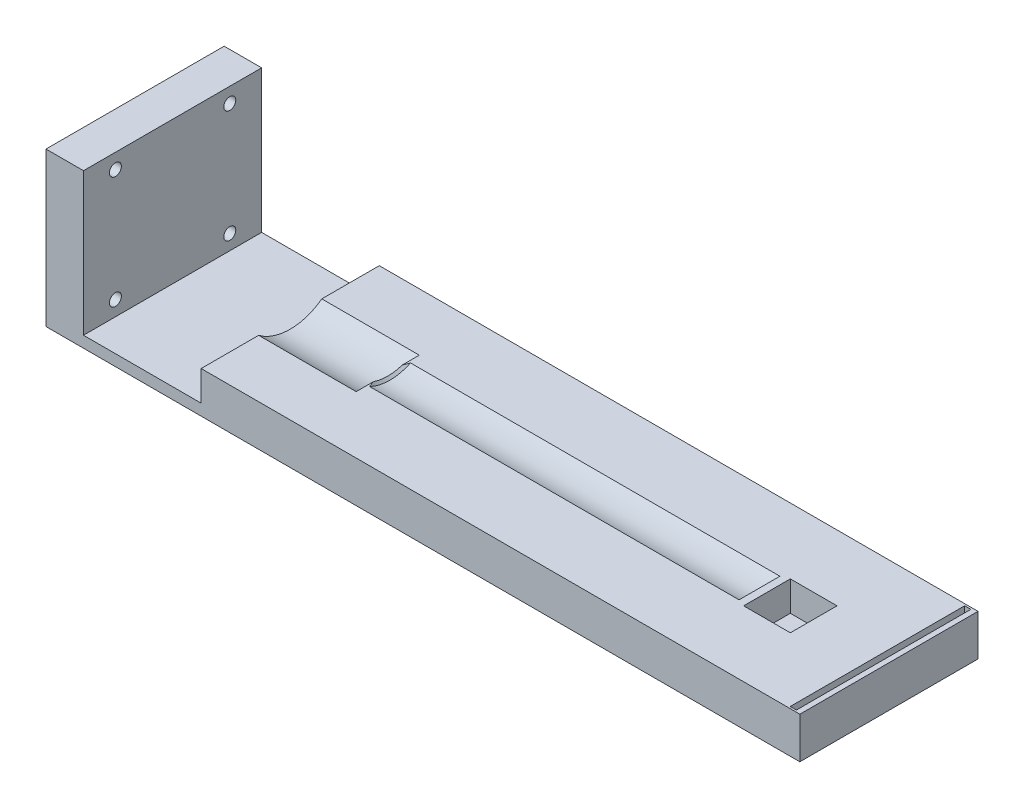
ISO-10303-21;
HEADER;
FILE_DESCRIPTION(('STEP AP214'),'2;1');
FILE_NAME('part.step','',(''),(''),'','','');
FILE_SCHEMA(('AUTOMOTIVE_DESIGN { 1 0 10303 214 1 1 1 1 }'));
ENDSEC;
DATA;
#1=APPLICATION_CONTEXT('core data for automotive mechanical design processes');
#2=APPLICATION_PROTOCOL_DEFINITION('international standard','automotive_design',2000,#1);
#3=PRODUCT_CONTEXT('',#1,'mechanical');
#4=PRODUCT('Part','Part','',(#3));
#5=PRODUCT_RELATED_PRODUCT_CATEGORY('part','',(#4));
#6=PRODUCT_DEFINITION_FORMATION('','',#4);
#7=PRODUCT_DEFINITION_CONTEXT('part definition',#1,'design');
#8=PRODUCT_DEFINITION('design','',#6,#7);
#9=PRODUCT_DEFINITION_SHAPE('','',#8);
#10=(LENGTH_UNIT() NAMED_UNIT(*) SI_UNIT(.MILLI.,.METRE.));
#11=(NAMED_UNIT(*) PLANE_ANGLE_UNIT() SI_UNIT($,.RADIAN.));
#12=(NAMED_UNIT(*) SI_UNIT($,.STERADIAN.) SOLID_ANGLE_UNIT());
#13=UNCERTAINTY_MEASURE_WITH_UNIT(LENGTH_MEASURE(1.E-05),#10,'distance_accuracy_value','');
#14=(GEOMETRIC_REPRESENTATION_CONTEXT(3) GLOBAL_UNCERTAINTY_ASSIGNED_CONTEXT((#13)) GLOBAL_UNIT_ASSIGNED_CONTEXT((#10,
#11,#12)) REPRESENTATION_CONTEXT('',''));
#15=CARTESIAN_POINT('',(0.,0.,0.));
#16=DIRECTION('',(0.,0.,1.));
#17=DIRECTION('',(1.,0.,0.));
#18=AXIS2_PLACEMENT_3D('',#15,#16,#17);
#19=CARTESIAN_POINT('',(0.,38.,0.));
#20=DIRECTION('',(0.,1.,0.));
#21=DIRECTION('',(0.,0.,1.));
#22=AXIS2_PLACEMENT_3D('',#19,#20,#21);
#23=PLANE('',#22);
#24=DIRECTION('',(1.,0.,0.));
#25=VECTOR('',#24,1.);
#26=CARTESIAN_POINT('',(586.457736953419,38.,1398.46078665923));
#27=LINE('',#26,#25);
#28=CARTESIAN_POINT('',(584.80773695342,38.,1398.46078665923));
#29=VERTEX_POINT('',#28);
#30=CARTESIAN_POINT('',(586.457736953419,38.,1398.46078665923));
#31=VERTEX_POINT('',#30);
#32=EDGE_CURVE('E159',#29,#31,#27,.T.);
#33=ORIENTED_EDGE('',*,*,#32,.F.);
#34=DIRECTION('',(0.,0.,1.));
#35=VECTOR('',#34,1.);
#36=CARTESIAN_POINT('',(584.80773695342,38.,1398.46078665923));
#37=LINE('',#36,#35);
#38=CARTESIAN_POINT('',(584.80773695342,38.,1351.96078665923));
#39=VERTEX_POINT('',#38);
#40=EDGE_CURVE('E308',#39,#29,#37,.T.);
#41=ORIENTED_EDGE('',*,*,#40,.F.);
#42=DIRECTION('',(-1.,0.,0.));
#43=VECTOR('',#42,1.);
#44=CARTESIAN_POINT('',(584.80773695342,38.,1351.96078665923));
#45=LINE('',#44,#43);
#46=CARTESIAN_POINT('',(586.457736953419,38.,1351.96078665923));
#47=VERTEX_POINT('',#46);
#48=EDGE_CURVE('E311',#47,#39,#45,.T.);
#49=ORIENTED_EDGE('',*,*,#48,.F.);
#50=DIRECTION('',(0.,0.,-1.));
#51=VECTOR('',#50,1.);
#52=CARTESIAN_POINT('',(586.457736953419,38.,1351.96078665923));
#53=LINE('',#52,#51);
#54=EDGE_CURVE('E317',#31,#47,#53,.T.);
#55=ORIENTED_EDGE('',*,*,#54,.F.);
#56=EDGE_LOOP('',(#33,#41,#49,#55));
#57=FACE_BOUND('',#56,.T.);
#58=DIRECTION('',(0.,0.,1.));
#59=VECTOR('',#58,1.);
#60=CARTESIAN_POINT('',(428.238471137286,38.,1355.96078649868));
#61=LINE('',#60,#59);
#62=CARTESIAN_POINT('',(428.238471137286,38.,1351.46078649868));
#63=VERTEX_POINT('',#62);
#64=CARTESIAN_POINT('',(428.238471137286,38.,1366.79413649423));
#65=VERTEX_POINT('',#64);
#66=EDGE_CURVE('E336',#63,#65,#61,.T.);
#67=ORIENTED_EDGE('',*,*,#66,.T.);
#68=DIRECTION('',(-1.,0.,0.));
#69=VECTOR('',#68,1.);
#70=CARTESIAN_POINT('',(454.238471137286,38.,1366.79413649423));
#71=LINE('',#70,#69);
#72=CARTESIAN_POINT('',(454.238471137286,38.,1366.79413649423));
#73=VERTEX_POINT('',#72);
#74=EDGE_CURVE('E355',#65,#73,#71,.F.);
#75=ORIENTED_EDGE('',*,*,#74,.T.);
#76=DIRECTION('',(0.,0.,-1.));
#77=VECTOR('',#76,1.);
#78=CARTESIAN_POINT('',(454.238471137286,38.,0.));
#79=LINE('',#78,#77);
#80=CARTESIAN_POINT('',(454.238471137286,38.,1371.35244531893));
#81=VERTEX_POINT('',#80);
#82=EDGE_CURVE('E364',#81,#73,#79,.T.);
#83=ORIENTED_EDGE('',*,*,#82,.F.);
#84=CARTESIAN_POINT('',(454.85843695342,38.,1369.76058969961));
#85=CARTESIAN_POINT('',(454.687245121652,38.,1370.14528895966));
#86=CARTESIAN_POINT('',(454.528040637761,38.,1370.53602997257));
#87=CARTESIAN_POINT('',(454.23998352128,38.,1371.33005467567));
#88=CARTESIAN_POINT('',(454.111242272088,38.,1371.733378472));
#89=CARTESIAN_POINT('',(453.947262232903,38.,1372.34384819718));
#90=CARTESIAN_POINT('',(453.897649155964,38.,1372.5471356974));
#91=CARTESIAN_POINT('',(453.808555258525,38.,1372.955903581));
#92=CARTESIAN_POINT('',(453.769072974235,38.,1373.16138364311));
#93=CARTESIAN_POINT('',(453.701011658274,38.,1373.57387141667));
#94=CARTESIAN_POINT('',(453.672418280449,38.,1373.78087674924));
#95=CARTESIAN_POINT('',(453.62664030239,38.,1374.19614968094));
#96=CARTESIAN_POINT('',(453.609455441376,38.,1374.4044172511));
#97=CARTESIAN_POINT('',(453.587528775331,38.,1374.80929197523));
#98=CARTESIAN_POINT('',(453.582113145668,38.,1375.00586272785));
#99=CARTESIAN_POINT('',(453.581815278053,38.,1375.39900144742));
#100=CARTESIAN_POINT('',(453.586932439691,38.,1375.5955694139));
#101=CARTESIAN_POINT('',(453.607605760803,38.,1375.98823841877));
#102=CARTESIAN_POINT('',(453.623166307173,38.,1376.18433922617));
#103=CARTESIAN_POINT('',(453.664425939787,38.,1376.57548141519));
#104=CARTESIAN_POINT('',(453.690126487847,38.,1376.77052263995));
#105=CARTESIAN_POINT('',(453.781753309234,38.,1377.35316285786));
#106=CARTESIAN_POINT('',(453.862219370598,38.,1377.73853708681));
#107=CARTESIAN_POINT('',(454.056890061808,38.,1378.50062348835));
#108=CARTESIAN_POINT('',(454.171106309887,38.,1378.87733262985));
#109=CARTESIAN_POINT('',(454.340634871859,38.,1379.36898068917));
#110=CARTESIAN_POINT('',(454.38343477763,38.,1379.48837303201));
#111=CARTESIAN_POINT('',(454.471749895319,38.,1379.72610086492));
#112=CARTESIAN_POINT('',(454.517263993479,38.,1379.8444367659));
#113=CARTESIAN_POINT('',(454.61068591144,38.,1380.07969919944));
#114=CARTESIAN_POINT('',(454.658585240472,38.,1380.19662911642));
#115=CARTESIAN_POINT('',(454.756767725996,38.,1380.42953171805));
#116=CARTESIAN_POINT('',(454.807051695879,38.,1380.54550406));
#117=CARTESIAN_POINT('',(454.85843695342,38.,1380.66098361884));
#118=B_SPLINE_CURVE_WITH_KNOTS('',3,(#84,#85,#86,#87,#88,#89,#90,#91,#92,#93,#94,#95,#96,#97,
#98,#99,#100,#101,#102,#103,#104,#105,#106,#107,#108,#109,#110,#111,#112,#113,#114,#115,#116,
#117),.UNSPECIFIED.,.F.,.F.,(4,2,2,2,2,2,2,2,2,2,2,2,2,2,2,2,4),(0.,1.26404332694489,
2.53263935458804,3.16017054690521,3.78761101652659,4.41422194846123,5.04081855667202,
5.63047575284557,6.22009933725068,6.80997075679138,7.39992724520645,8.57906657195127,
9.75861228181269,10.1390914324494,10.5194155153526,10.8984710074119,11.2776567369307),.UNSPECIFIED.);
#119=CARTESIAN_POINT('',(454.85773695342,38.,1369.7621629798));
#120=VERTEX_POINT('',#119);
#121=EDGE_CURVE('E376',#120,#81,#118,.T.);
#122=ORIENTED_EDGE('',*,*,#121,.F.);
#123=DIRECTION('',(1.,0.,0.));
#124=VECTOR('',#123,1.);
#125=CARTESIAN_POINT('',(449.85773695342,38.,1369.7621629798));
#126=LINE('',#125,#124);
#127=CARTESIAN_POINT('',(553.357736953419,38.,1369.7621629798));
#128=VERTEX_POINT('',#127);
#129=EDGE_CURVE('E351',#120,#128,#126,.T.);
#130=ORIENTED_EDGE('',*,*,#129,.T.);
#131=DIRECTION('',(0.,0.,1.));
#132=VECTOR('',#131,1.);
#133=CARTESIAN_POINT('',(553.357736953419,38.,0.));
#134=LINE('',#133,#132);
#135=CARTESIAN_POINT('',(553.357736953419,38.,1380.65941033865));
#136=VERTEX_POINT('',#135);
#137=EDGE_CURVE('E354',#128,#136,#134,.T.);
#138=ORIENTED_EDGE('',*,*,#137,.T.);
#139=DIRECTION('',(1.,0.,0.));
#140=VECTOR('',#139,1.);
#141=CARTESIAN_POINT('',(449.85773695342,38.,1380.65941033866));
#142=LINE('',#141,#140);
#143=CARTESIAN_POINT('',(454.85773695342,38.,1380.65941033866));
#144=VERTEX_POINT('',#143);
#145=EDGE_CURVE('E358',#136,#144,#142,.F.);
#146=ORIENTED_EDGE('',*,*,#145,.T.);
#147=CARTESIAN_POINT('',(454.238471137286,38.,1379.06912799953));
#148=VERTEX_POINT('',#147);
#149=EDGE_CURVE('E368',#148,#144,#118,.T.);
#150=ORIENTED_EDGE('',*,*,#149,.F.);
#151=CARTESIAN_POINT('',(454.238471137286,38.,1383.62743682423));
#152=VERTEX_POINT('',#151);
#153=EDGE_CURVE('E359',#152,#148,#79,.T.);
#154=ORIENTED_EDGE('',*,*,#153,.F.);
#155=DIRECTION('',(-1.,0.,0.));
#156=VECTOR('',#155,1.);
#157=CARTESIAN_POINT('',(454.238471137286,38.,1383.62743682423));
#158=LINE('',#157,#156);
#159=CARTESIAN_POINT('',(428.238471137286,38.,1383.62743682423));
#160=VERTEX_POINT('',#159);
#161=EDGE_CURVE('E367',#152,#160,#158,.T.);
#162=ORIENTED_EDGE('',*,*,#161,.T.);
#163=CARTESIAN_POINT('',(428.238471137286,38.,1398.96078665923));
#164=VERTEX_POINT('',#163);
#165=EDGE_CURVE('E445',#160,#164,#61,.T.);
#166=ORIENTED_EDGE('',*,*,#165,.T.);
#167=DIRECTION('',(1.,0.,0.));
#168=VECTOR('',#167,1.);
#169=CARTESIAN_POINT('',(428.238471137286,38.,1398.96078665923));
#170=LINE('',#169,#168);
#171=CARTESIAN_POINT('',(587.872687737076,38.,1398.96078665923));
#172=VERTEX_POINT('',#171);
#173=EDGE_CURVE('E463',#164,#172,#170,.T.);
#174=ORIENTED_EDGE('',*,*,#173,.T.);
#175=DIRECTION('',(0.,0.,1.));
#176=VECTOR('',#175,1.);
#177=CARTESIAN_POINT('',(587.872687737076,38.,1398.96078665923));
#178=LINE('',#177,#176);
#179=CARTESIAN_POINT('',(587.872687737076,38.,1351.46078649868));
#180=VERTEX_POINT('',#179);
#181=EDGE_CURVE('E437',#180,#172,#178,.T.);
#182=ORIENTED_EDGE('',*,*,#181,.F.);
#183=DIRECTION('',(-1.,0.,0.));
#184=VECTOR('',#183,1.);
#185=CARTESIAN_POINT('',(601.872687737076,38.,1351.46078649868));
#186=LINE('',#185,#184);
#187=EDGE_CURVE('E344',#180,#63,#186,.T.);
#188=ORIENTED_EDGE('',*,*,#187,.T.);
#189=EDGE_LOOP('',(#67,#75,#83,#122,#130,#138,#146,#150,#154,#162,#166,#174,#182,#188));
#190=FACE_BOUND('',#189,.T.);
#191=DIRECTION('',(1.,0.,0.));
#192=VECTOR('',#191,1.);
#193=CARTESIAN_POINT('',(0.,38.,1368.98578665923));
#194=LINE('',#193,#192);
#195=CARTESIAN_POINT('',(555.357736953419,38.,1368.98578665923));
#196=VERTEX_POINT('',#195);
#197=CARTESIAN_POINT('',(567.807736953419,38.,1368.98578665923));
#198=VERTEX_POINT('',#197);
#199=EDGE_CURVE('E341',#196,#198,#194,.T.);
#200=ORIENTED_EDGE('',*,*,#199,.T.);
#201=DIRECTION('',(0.,0.,1.));
#202=VECTOR('',#201,1.);
#203=CARTESIAN_POINT('',(567.807736953419,38.,0.));
#204=LINE('',#203,#202);
#205=CARTESIAN_POINT('',(567.807736953419,38.,1381.43578665923));
#206=VERTEX_POINT('',#205);
#207=EDGE_CURVE('E337',#198,#206,#204,.T.);
#208=ORIENTED_EDGE('',*,*,#207,.T.);
#209=DIRECTION('',(-1.,0.,0.));
#210=VECTOR('',#209,1.);
#211=CARTESIAN_POINT('',(0.,38.,1381.43578665923));
#212=LINE('',#211,#210);
#213=CARTESIAN_POINT('',(555.357736953419,38.,1381.43578665923));
#214=VERTEX_POINT('',#213);
#215=EDGE_CURVE('E340',#206,#214,#212,.T.);
#216=ORIENTED_EDGE('',*,*,#215,.T.);
#217=DIRECTION('',(0.,0.,-1.));
#218=VECTOR('',#217,1.);
#219=CARTESIAN_POINT('',(555.357736953419,38.,0.));
#220=LINE('',#219,#218);
#221=EDGE_CURVE('E345',#214,#196,#220,.T.);
#222=ORIENTED_EDGE('',*,*,#221,.T.);
#223=EDGE_LOOP('',(#200,#208,#216,#222));
#224=FACE_BOUND('',#223,.T.);
#225=ADVANCED_FACE('F144',(#57,#190,#224),#23,.T.);
#226=CARTESIAN_POINT('',(0.,30.,0.));
#227=DIRECTION('',(0.,1.,0.));
#228=DIRECTION('',(0.,0.,1.));
#229=AXIS2_PLACEMENT_3D('',#226,#227,#228);
#230=PLANE('',#229);
#231=DIRECTION('',(0.,0.,-1.));
#232=VECTOR('',#231,1.);
#233=CARTESIAN_POINT('',(396.872687737076,30.,1355.96078649868));
#234=LINE('',#233,#232);
#235=CARTESIAN_POINT('',(396.872687737076,30.,1398.96078665923));
#236=VERTEX_POINT('',#235);
#237=CARTESIAN_POINT('',(396.872687737076,30.,1351.46078649868));
#238=VERTEX_POINT('',#237);
#239=EDGE_CURVE('E377',#236,#238,#234,.T.);
#240=ORIENTED_EDGE('',*,*,#239,.F.);
#241=DIRECTION('',(-1.,0.,0.));
#242=VECTOR('',#241,1.);
#243=CARTESIAN_POINT('',(428.238471137286,30.,1398.96078665923));
#244=LINE('',#243,#242);
#245=CARTESIAN_POINT('',(428.238471137286,30.,1398.96078665923));
#246=VERTEX_POINT('',#245);
#247=EDGE_CURVE('E484',#246,#236,#244,.T.);
#248=ORIENTED_EDGE('',*,*,#247,.F.);
#249=DIRECTION('',(0.,0.,1.));
#250=VECTOR('',#249,1.);
#251=CARTESIAN_POINT('',(428.238471137286,30.,1355.96078649868));
#252=LINE('',#251,#250);
#253=CARTESIAN_POINT('',(428.238471137286,30.,1351.46078649868));
#254=VERTEX_POINT('',#253);
#255=EDGE_CURVE('E461',#254,#246,#252,.T.);
#256=ORIENTED_EDGE('',*,*,#255,.F.);
#257=DIRECTION('',(-1.,0.,0.));
#258=VECTOR('',#257,1.);
#259=CARTESIAN_POINT('',(428.238471137286,30.,1351.46078649868));
#260=LINE('',#259,#258);
#261=EDGE_CURVE('E464',#254,#238,#260,.T.);
#262=ORIENTED_EDGE('',*,*,#261,.T.);
#263=EDGE_LOOP('',(#240,#248,#256,#262));
#264=FACE_BOUND('',#263,.T.);
#265=ADVANCED_FACE('F407',(#264),#230,.T.);
#266=CARTESIAN_POINT('',(428.238471137286,38.,1355.96078649868));
#267=DIRECTION('',(1.,0.,0.));
#268=DIRECTION('',(0.,0.,-1.));
#269=AXIS2_PLACEMENT_3D('',#266,#267,#268);
#270=PLANE('',#269);
#271=ORIENTED_EDGE('',*,*,#165,.F.);
#272=CARTESIAN_POINT('',(428.238471137286,49.25,1375.21078665923));
#273=DIRECTION('',(1.,0.,0.));
#274=DIRECTION('',(0.,0.,-1.));
#275=AXIS2_PLACEMENT_3D('',#272,#273,#274);
#276=CIRCLE('',#275,14.05);
#277=EDGE_CURVE('E348',#160,#65,#276,.T.);
#278=ORIENTED_EDGE('',*,*,#277,.T.);
#279=ORIENTED_EDGE('',*,*,#66,.F.);
#280=DIRECTION('',(0.,-1.,0.));
#281=VECTOR('',#280,1.);
#282=CARTESIAN_POINT('',(428.238471137286,38.,1351.46078649868));
#283=LINE('',#282,#281);
#284=EDGE_CURVE('E440',#63,#254,#283,.T.);
#285=ORIENTED_EDGE('',*,*,#284,.T.);
#286=ORIENTED_EDGE('',*,*,#255,.T.);
#287=DIRECTION('',(0.,1.,0.));
#288=VECTOR('',#287,1.);
#289=CARTESIAN_POINT('',(428.238471137286,27.,1398.96078665923));
#290=LINE('',#289,#288);
#291=EDGE_CURVE('E486',#246,#164,#290,.T.);
#292=ORIENTED_EDGE('',*,*,#291,.T.);
#293=EDGE_LOOP('',(#271,#278,#279,#285,#286,#292));
#294=FACE_BOUND('',#293,.T.);
#295=ADVANCED_FACE('F413',(#294),#270,.F.);
#296=CARTESIAN_POINT('',(0.,27.,0.));
#297=DIRECTION('',(0.,-1.,0.));
#298=DIRECTION('',(0.,0.,-1.));
#299=AXIS2_PLACEMENT_3D('',#296,#297,#298);
#300=PLANE('',#299);
#301=DIRECTION('',(-1.,0.,0.));
#302=VECTOR('',#301,1.);
#303=CARTESIAN_POINT('',(601.872687737076,27.,1351.46078649868));
#304=LINE('',#303,#302);
#305=CARTESIAN_POINT('',(587.872687737076,27.,1351.46078649868));
#306=VERTEX_POINT('',#305);
#307=CARTESIAN_POINT('',(386.872687737076,27.,1351.46078649868));
#308=VERTEX_POINT('',#307);
#309=EDGE_CURVE('E455',#306,#308,#304,.T.);
#310=ORIENTED_EDGE('',*,*,#309,.F.);
#311=DIRECTION('',(0.,0.,-1.));
#312=VECTOR('',#311,1.);
#313=CARTESIAN_POINT('',(587.872687737076,27.,1398.96078665923));
#314=LINE('',#313,#312);
#315=CARTESIAN_POINT('',(587.872687737076,27.,1398.96078665923));
#316=VERTEX_POINT('',#315);
#317=EDGE_CURVE('E449',#316,#306,#314,.T.);
#318=ORIENTED_EDGE('',*,*,#317,.F.);
#319=DIRECTION('',(1.,0.,0.));
#320=VECTOR('',#319,1.);
#321=CARTESIAN_POINT('',(428.238471137286,27.,1398.96078665923));
#322=LINE('',#321,#320);
#323=CARTESIAN_POINT('',(386.872687737076,27.,1398.96078665923));
#324=VERTEX_POINT('',#323);
#325=EDGE_CURVE('E481',#324,#316,#322,.T.);
#326=ORIENTED_EDGE('',*,*,#325,.F.);
#327=DIRECTION('',(0.,0.,-1.));
#328=VECTOR('',#327,1.);
#329=CARTESIAN_POINT('',(386.872687737076,27.,1394.46408512789));
#330=LINE('',#329,#328);
#331=EDGE_CURVE('E485',#324,#308,#330,.T.);
#332=ORIENTED_EDGE('',*,*,#331,.T.);
#333=EDGE_LOOP('',(#310,#318,#326,#332));
#334=FACE_BOUND('',#333,.T.);
#335=ADVANCED_FACE('F585',(#334),#300,.T.);
#336=CARTESIAN_POINT('',(0.,0.,1398.96078665923));
#337=DIRECTION('',(0.,0.,1.));
#338=DIRECTION('',(1.,0.,0.));
#339=AXIS2_PLACEMENT_3D('',#336,#337,#338);
#340=PLANE('',#339);
#341=ORIENTED_EDGE('',*,*,#325,.T.);
#342=DIRECTION('',(0.,-1.,0.));
#343=VECTOR('',#342,1.);
#344=CARTESIAN_POINT('',(587.872687737076,38.,1398.96078665923));
#345=LINE('',#344,#343);
#346=EDGE_CURVE('E447',#172,#316,#345,.T.);
#347=ORIENTED_EDGE('',*,*,#346,.F.);
#348=ORIENTED_EDGE('',*,*,#173,.F.);
#349=ORIENTED_EDGE('',*,*,#291,.F.);
#350=ORIENTED_EDGE('',*,*,#247,.T.);
#351=DIRECTION('',(0.,-1.,0.));
#352=VECTOR('',#351,1.);
#353=CARTESIAN_POINT('',(396.872687737076,68.,1398.96078665923));
#354=LINE('',#353,#352);
#355=CARTESIAN_POINT('',(396.872687737076,68.,1398.96078665923));
#356=VERTEX_POINT('',#355);
#357=EDGE_CURVE('E491',#356,#236,#354,.T.);
#358=ORIENTED_EDGE('',*,*,#357,.F.);
#359=DIRECTION('',(1.,0.,0.));
#360=VECTOR('',#359,1.);
#361=CARTESIAN_POINT('',(386.872687737076,68.,1398.96078665923));
#362=LINE('',#361,#360);
#363=CARTESIAN_POINT('',(386.872687737076,68.,1398.96078665923));
#364=VERTEX_POINT('',#363);
#365=EDGE_CURVE('E495',#364,#356,#362,.T.);
#366=ORIENTED_EDGE('',*,*,#365,.F.);
#367=DIRECTION('',(0.,-1.,0.));
#368=VECTOR('',#367,1.);
#369=CARTESIAN_POINT('',(386.872687737076,68.,1398.96078665923));
#370=LINE('',#369,#368);
#371=EDGE_CURVE('E458',#364,#324,#370,.T.);
#372=ORIENTED_EDGE('',*,*,#371,.T.);
#373=EDGE_LOOP('',(#341,#347,#348,#349,#350,#358,#366,#372));
#374=FACE_BOUND('',#373,.T.);
#375=ADVANCED_FACE('F543',(#374),#340,.T.);
#376=CARTESIAN_POINT('',(0.,0.,1351.46078649868));
#377=DIRECTION('',(0.,0.,1.));
#378=DIRECTION('',(1.,0.,0.));
#379=AXIS2_PLACEMENT_3D('',#376,#377,#378);
#380=PLANE('',#379);
#381=DIRECTION('',(0.,1.,0.));
#382=VECTOR('',#381,1.);
#383=CARTESIAN_POINT('',(587.872687737076,38.,1351.46078649868));
#384=LINE('',#383,#382);
#385=EDGE_CURVE('E452',#306,#180,#384,.T.);
#386=ORIENTED_EDGE('',*,*,#385,.F.);
#387=ORIENTED_EDGE('',*,*,#309,.T.);
#388=DIRECTION('',(0.,-1.,0.));
#389=VECTOR('',#388,1.);
#390=CARTESIAN_POINT('',(386.872687737076,68.,1351.46078649868));
#391=LINE('',#390,#389);
#392=CARTESIAN_POINT('',(386.872687737076,68.,1351.46078649868));
#393=VERTEX_POINT('',#392);
#394=EDGE_CURVE('E467',#393,#308,#391,.T.);
#395=ORIENTED_EDGE('',*,*,#394,.F.);
#396=DIRECTION('',(-1.,0.,0.));
#397=VECTOR('',#396,1.);
#398=CARTESIAN_POINT('',(396.872687737076,68.,1351.46078649868));
#399=LINE('',#398,#397);
#400=CARTESIAN_POINT('',(396.872687737076,68.,1351.46078649868));
#401=VERTEX_POINT('',#400);
#402=EDGE_CURVE('E471',#401,#393,#399,.T.);
#403=ORIENTED_EDGE('',*,*,#402,.F.);
#404=DIRECTION('',(0.,-1.,0.));
#405=VECTOR('',#404,1.);
#406=CARTESIAN_POINT('',(396.872687737076,68.,1351.46078649868));
#407=LINE('',#406,#405);
#408=EDGE_CURVE('E457',#401,#238,#407,.T.);
#409=ORIENTED_EDGE('',*,*,#408,.T.);
#410=ORIENTED_EDGE('',*,*,#261,.F.);
#411=ORIENTED_EDGE('',*,*,#284,.F.);
#412=ORIENTED_EDGE('',*,*,#187,.F.);
#413=EDGE_LOOP('',(#386,#387,#395,#403,#409,#410,#411,#412));
#414=FACE_BOUND('',#413,.T.);
#415=ADVANCED_FACE('F536',(#414),#380,.F.);
#416=CARTESIAN_POINT('',(386.872687737076,30.,1355.96078649868));
#417=DIRECTION('',(1.,0.,0.));
#418=DIRECTION('',(0.,0.,-1.));
#419=AXIS2_PLACEMENT_3D('',#416,#417,#418);
#420=PLANE('',#419);
#421=CARTESIAN_POINT('',(386.872687737076,64.,1359.96078649868));
#422=DIRECTION('',(1.,0.,0.));
#423=DIRECTION('',(0.,0.,-1.));
#424=AXIS2_PLACEMENT_3D('',#421,#422,#423);
#425=CIRCLE('',#424,1.60000000000013);
#426=CARTESIAN_POINT('',(386.872687737076,64.,1358.36078649868));
#427=VERTEX_POINT('',#426);
#428=EDGE_CURVE('E478',#427,#427,#425,.T.);
#429=ORIENTED_EDGE('',*,*,#428,.T.);
#430=EDGE_LOOP('',(#429));
#431=FACE_BOUND('',#430,.T.);
#432=CARTESIAN_POINT('',(386.872687737076,34.,1359.96078649868));
#433=DIRECTION('',(1.,0.,0.));
#434=DIRECTION('',(0.,0.,-1.));
#435=AXIS2_PLACEMENT_3D('',#432,#433,#434);
#436=CIRCLE('',#435,1.60000000000013);
#437=CARTESIAN_POINT('',(386.872687737076,34.,1358.36078649868));
#438=VERTEX_POINT('',#437);
#439=EDGE_CURVE('E516',#438,#438,#436,.T.);
#440=ORIENTED_EDGE('',*,*,#439,.T.);
#441=EDGE_LOOP('',(#440));
#442=FACE_BOUND('',#441,.T.);
#443=CARTESIAN_POINT('',(386.872687737076,34.,1390.46078665923));
#444=DIRECTION('',(1.,0.,0.));
#445=DIRECTION('',(0.,0.,-1.));
#446=AXIS2_PLACEMENT_3D('',#443,#444,#445);
#447=CIRCLE('',#446,1.60000000000013);
#448=CARTESIAN_POINT('',(386.872687737076,34.,1388.86078665923));
#449=VERTEX_POINT('',#448);
#450=EDGE_CURVE('E519',#449,#449,#447,.T.);
#451=ORIENTED_EDGE('',*,*,#450,.T.);
#452=EDGE_LOOP('',(#451));
#453=FACE_BOUND('',#452,.T.);
#454=CARTESIAN_POINT('',(386.872687737076,64.,1390.46078665923));
#455=DIRECTION('',(1.,0.,0.));
#456=DIRECTION('',(0.,0.,-1.));
#457=AXIS2_PLACEMENT_3D('',#454,#455,#456);
#458=CIRCLE('',#457,1.60000000000013);
#459=CARTESIAN_POINT('',(386.872687737076,64.,1388.86078665923));
#460=VERTEX_POINT('',#459);
#461=EDGE_CURVE('E470',#460,#460,#458,.T.);
#462=ORIENTED_EDGE('',*,*,#461,.T.);
#463=EDGE_LOOP('',(#462));
#464=FACE_BOUND('',#463,.T.);
#465=ORIENTED_EDGE('',*,*,#331,.F.);
#466=ORIENTED_EDGE('',*,*,#371,.F.);
#467=DIRECTION('',(0.,0.,1.));
#468=VECTOR('',#467,1.);
#469=CARTESIAN_POINT('',(386.872687737076,68.,1394.46078665923));
#470=LINE('',#469,#468);
#471=EDGE_CURVE('E494',#393,#364,#470,.T.);
#472=ORIENTED_EDGE('',*,*,#471,.F.);
#473=ORIENTED_EDGE('',*,*,#394,.T.);
#474=EDGE_LOOP('',(#465,#466,#472,#473));
#475=FACE_BOUND('',#474,.T.);
#476=ADVANCED_FACE('F539',(#431,#442,#453,#464,#475),#420,.F.);
#477=CARTESIAN_POINT('',(396.872687737076,68.,1355.96078649868));
#478=DIRECTION('',(-1.,0.,0.));
#479=DIRECTION('',(0.,0.,1.));
#480=AXIS2_PLACEMENT_3D('',#477,#478,#479);
#481=PLANE('',#480);
#482=CARTESIAN_POINT('',(396.872687737076,64.,1390.46078665923));
#483=DIRECTION('',(1.,0.,0.));
#484=DIRECTION('',(0.,0.,-1.));
#485=AXIS2_PLACEMENT_3D('',#482,#483,#484);
#486=CIRCLE('',#485,1.60000000000013);
#487=CARTESIAN_POINT('',(396.872687737076,64.,1388.86078665923));
#488=VERTEX_POINT('',#487);
#489=EDGE_CURVE('E450',#488,#488,#486,.T.);
#490=ORIENTED_EDGE('',*,*,#489,.F.);
#491=EDGE_LOOP('',(#490));
#492=FACE_BOUND('',#491,.T.);
#493=CARTESIAN_POINT('',(396.872687737076,34.,1390.46078665923));
#494=DIRECTION('',(1.,0.,0.));
#495=DIRECTION('',(0.,0.,-1.));
#496=AXIS2_PLACEMENT_3D('',#493,#494,#495);
#497=CIRCLE('',#496,1.60000000000013);
#498=CARTESIAN_POINT('',(396.872687737076,34.,1388.86078665923));
#499=VERTEX_POINT('',#498);
#500=EDGE_CURVE('E507',#499,#499,#497,.T.);
#501=ORIENTED_EDGE('',*,*,#500,.F.);
#502=EDGE_LOOP('',(#501));
#503=FACE_BOUND('',#502,.T.);
#504=CARTESIAN_POINT('',(396.872687737076,34.,1359.96078649868));
#505=DIRECTION('',(1.,0.,0.));
#506=DIRECTION('',(0.,0.,-1.));
#507=AXIS2_PLACEMENT_3D('',#504,#505,#506);
#508=CIRCLE('',#507,1.60000000000013);
#509=CARTESIAN_POINT('',(396.872687737076,34.,1358.36078649868));
#510=VERTEX_POINT('',#509);
#511=EDGE_CURVE('E504',#510,#510,#508,.T.);
#512=ORIENTED_EDGE('',*,*,#511,.F.);
#513=EDGE_LOOP('',(#512));
#514=FACE_BOUND('',#513,.T.);
#515=CARTESIAN_POINT('',(396.872687737076,64.,1359.96078649868));
#516=DIRECTION('',(1.,0.,0.));
#517=DIRECTION('',(0.,0.,-1.));
#518=AXIS2_PLACEMENT_3D('',#515,#516,#517);
#519=CIRCLE('',#518,1.60000000000013);
#520=CARTESIAN_POINT('',(396.872687737076,64.,1358.36078649868));
#521=VERTEX_POINT('',#520);
#522=EDGE_CURVE('E474',#521,#521,#519,.T.);
#523=ORIENTED_EDGE('',*,*,#522,.F.);
#524=EDGE_LOOP('',(#523));
#525=FACE_BOUND('',#524,.T.);
#526=ORIENTED_EDGE('',*,*,#239,.T.);
#527=ORIENTED_EDGE('',*,*,#408,.F.);
#528=DIRECTION('',(0.,0.,-1.));
#529=VECTOR('',#528,1.);
#530=CARTESIAN_POINT('',(396.872687737076,68.,1355.96078649868));
#531=LINE('',#530,#529);
#532=EDGE_CURVE('E475',#356,#401,#531,.T.);
#533=ORIENTED_EDGE('',*,*,#532,.F.);
#534=ORIENTED_EDGE('',*,*,#357,.T.);
#535=EDGE_LOOP('',(#526,#527,#533,#534));
#536=FACE_BOUND('',#535,.T.);
#537=ADVANCED_FACE('F531',(#492,#503,#514,#525,#536),#481,.F.);
#538=CARTESIAN_POINT('',(0.,68.,0.));
#539=DIRECTION('',(0.,-1.,0.));
#540=DIRECTION('',(0.,0.,-1.));
#541=AXIS2_PLACEMENT_3D('',#538,#539,#540);
#542=PLANE('',#541);
#543=ORIENTED_EDGE('',*,*,#471,.T.);
#544=ORIENTED_EDGE('',*,*,#365,.T.);
#545=ORIENTED_EDGE('',*,*,#532,.T.);
#546=ORIENTED_EDGE('',*,*,#402,.T.);
#547=EDGE_LOOP('',(#543,#544,#545,#546));
#548=FACE_BOUND('',#547,.T.);
#549=ADVANCED_FACE('F526',(#548),#542,.F.);
#550=CARTESIAN_POINT('',(358.872687737076,64.,1359.96078649868));
#551=DIRECTION('',(1.,0.,0.));
#552=DIRECTION('',(0.,0.,-1.));
#553=AXIS2_PLACEMENT_3D('',#550,#551,#552);
#554=CYLINDRICAL_SURFACE('',#553,1.60000000000013);
#555=ORIENTED_EDGE('',*,*,#522,.T.);
#556=EDGE_LOOP('',(#555));
#557=FACE_BOUND('',#556,.T.);
#558=ORIENTED_EDGE('',*,*,#428,.F.);
#559=EDGE_LOOP('',(#558));
#560=FACE_BOUND('',#559,.T.);
#561=ADVANCED_FACE('F595',(#557,#560),#554,.F.);
#562=CARTESIAN_POINT('',(358.872687737076,34.,1359.96078649868));
#563=DIRECTION('',(1.,0.,0.));
#564=DIRECTION('',(0.,0.,-1.));
#565=AXIS2_PLACEMENT_3D('',#562,#563,#564);
#566=CYLINDRICAL_SURFACE('',#565,1.60000000000013);
#567=ORIENTED_EDGE('',*,*,#511,.T.);
#568=EDGE_LOOP('',(#567));
#569=FACE_BOUND('',#568,.T.);
#570=ORIENTED_EDGE('',*,*,#439,.F.);
#571=EDGE_LOOP('',(#570));
#572=FACE_BOUND('',#571,.T.);
#573=ADVANCED_FACE('F591',(#569,#572),#566,.F.);
#574=CARTESIAN_POINT('',(358.872687737076,34.,1390.46078665923));
#575=DIRECTION('',(1.,0.,0.));
#576=DIRECTION('',(0.,0.,-1.));
#577=AXIS2_PLACEMENT_3D('',#574,#575,#576);
#578=CYLINDRICAL_SURFACE('',#577,1.60000000000013);
#579=ORIENTED_EDGE('',*,*,#500,.T.);
#580=EDGE_LOOP('',(#579));
#581=FACE_BOUND('',#580,.T.);
#582=ORIENTED_EDGE('',*,*,#450,.F.);
#583=EDGE_LOOP('',(#582));
#584=FACE_BOUND('',#583,.T.);
#585=ADVANCED_FACE('F594',(#581,#584),#578,.F.);
#586=CARTESIAN_POINT('',(358.872687737076,64.,1390.46078665923));
#587=DIRECTION('',(1.,0.,0.));
#588=DIRECTION('',(0.,0.,-1.));
#589=AXIS2_PLACEMENT_3D('',#586,#587,#588);
#590=CYLINDRICAL_SURFACE('',#589,1.60000000000013);
#591=ORIENTED_EDGE('',*,*,#489,.T.);
#592=EDGE_LOOP('',(#591));
#593=FACE_BOUND('',#592,.T.);
#594=ORIENTED_EDGE('',*,*,#461,.F.);
#595=EDGE_LOOP('',(#594));
#596=FACE_BOUND('',#595,.T.);
#597=ADVANCED_FACE('F579',(#593,#596),#590,.F.);
#598=CARTESIAN_POINT('',(587.872687737076,0.,0.));
#599=DIRECTION('',(1.,0.,0.));
#600=DIRECTION('',(0.,0.,-1.));
#601=AXIS2_PLACEMENT_3D('',#598,#599,#600);
#602=PLANE('',#601);
#603=ORIENTED_EDGE('',*,*,#346,.T.);
#604=ORIENTED_EDGE('',*,*,#317,.T.);
#605=ORIENTED_EDGE('',*,*,#385,.T.);
#606=ORIENTED_EDGE('',*,*,#181,.T.);
#607=EDGE_LOOP('',(#603,#604,#605,#606));
#608=FACE_BOUND('',#607,.T.);
#609=ADVANCED_FACE('F576',(#608),#602,.T.);
#610=CARTESIAN_POINT('',(454.238471137286,49.25,1375.21078665923));
#611=DIRECTION('',(-1.,0.,0.));
#612=DIRECTION('',(0.,0.,1.));
#613=AXIS2_PLACEMENT_3D('',#610,#611,#612);
#614=CYLINDRICAL_SURFACE('',#613,14.05);
#615=ORIENTED_EDGE('',*,*,#277,.F.);
#616=ORIENTED_EDGE('',*,*,#161,.F.);
#617=CARTESIAN_POINT('',(454.238471137286,49.25,1375.21078665923));
#618=DIRECTION('',(1.,0.,0.));
#619=DIRECTION('',(0.,0.,-1.));
#620=AXIS2_PLACEMENT_3D('',#617,#618,#619);
#621=CIRCLE('',#620,14.05);
#622=EDGE_CURVE('E363',#152,#73,#621,.T.);
#623=ORIENTED_EDGE('',*,*,#622,.T.);
#624=ORIENTED_EDGE('',*,*,#74,.F.);
#625=EDGE_LOOP('',(#615,#616,#623,#624));
#626=FACE_BOUND('',#625,.T.);
#627=ADVANCED_FACE('F552',(#626),#614,.F.);
#628=CARTESIAN_POINT('',(454.238471137286,49.25,1375.21078665923));
#629=DIRECTION('',(1.,0.,0.));
#630=DIRECTION('',(0.,0.,-1.));
#631=AXIS2_PLACEMENT_3D('',#628,#629,#630);
#632=PLANE('',#631);
#633=ORIENTED_EDGE('',*,*,#153,.T.);
#634=CARTESIAN_POINT('',(454.238471137286,49.2500000000001,1375.21078665923));
#635=DIRECTION('',(1.,0.,0.));
#636=DIRECTION('',(0.,1.,0.));
#637=AXIS2_PLACEMENT_3D('',#634,#635,#636);
#638=CIRCLE('',#637,11.8932458941302);
#639=EDGE_CURVE('E362',#148,#81,#638,.T.);
#640=ORIENTED_EDGE('',*,*,#639,.T.);
#641=ORIENTED_EDGE('',*,*,#82,.T.);
#642=ORIENTED_EDGE('',*,*,#622,.F.);
#643=EDGE_LOOP('',(#633,#640,#641,#642));
#644=FACE_BOUND('',#643,.T.);
#645=ADVANCED_FACE('F557',(#644),#632,.F.);
#646=CARTESIAN_POINT('',(449.85773695342,49.2500000000001,1375.21078665923));
#647=DIRECTION('',(1.,0.,0.));
#648=DIRECTION('',(0.,-1.,0.));
#649=AXIS2_PLACEMENT_3D('',#646,#647,#648);
#650=CYLINDRICAL_SURFACE('',#649,12.5);
#651=CARTESIAN_POINT('',(553.357736953419,49.2500000000001,1375.21078665923));
#652=DIRECTION('',(-1.,0.,0.));
#653=DIRECTION('',(0.,1.,0.));
#654=AXIS2_PLACEMENT_3D('',#651,#652,#653);
#655=CIRCLE('',#654,12.5);
#656=EDGE_CURVE('E432',#128,#136,#655,.T.);
#657=ORIENTED_EDGE('',*,*,#656,.F.);
#658=ORIENTED_EDGE('',*,*,#129,.F.);
#659=CARTESIAN_POINT('',(454.85773695342,49.2500000000001,1375.21078665923));
#660=DIRECTION('',(1.,0.,0.));
#661=DIRECTION('',(0.,0.,-1.));
#662=AXIS2_PLACEMENT_3D('',#659,#660,#661);
#663=CIRCLE('',#662,12.5);
#664=EDGE_CURVE('E375',#144,#120,#663,.T.);
#665=ORIENTED_EDGE('',*,*,#664,.F.);
#666=ORIENTED_EDGE('',*,*,#145,.F.);
#667=EDGE_LOOP('',(#657,#658,#665,#666));
#668=FACE_BOUND('',#667,.T.);
#669=ADVANCED_FACE('F563',(#668),#650,.F.);
#670=CARTESIAN_POINT('',(553.357736953419,49.2500000000001,1375.21078665923));
#671=DIRECTION('',(-1.,0.,0.));
#672=DIRECTION('',(0.,1.,0.));
#673=AXIS2_PLACEMENT_3D('',#670,#671,#672);
#674=PLANE('',#673);
#675=ORIENTED_EDGE('',*,*,#656,.T.);
#676=ORIENTED_EDGE('',*,*,#137,.F.);
#677=EDGE_LOOP('',(#675,#676));
#678=FACE_BOUND('',#677,.T.);
#679=ADVANCED_FACE('F385',(#678),#674,.T.);
#680=CARTESIAN_POINT('',(454.85773695342,49.2500000000001,1375.21078665923));
#681=DIRECTION('',(1.,0.,0.));
#682=DIRECTION('',(0.,0.,-1.));
#683=AXIS2_PLACEMENT_3D('',#680,#681,#682);
#684=CONICAL_SURFACE('',#683,12.5,0.77519337331036);
#685=ORIENTED_EDGE('',*,*,#121,.T.);
#686=ORIENTED_EDGE('',*,*,#639,.F.);
#687=ORIENTED_EDGE('',*,*,#149,.T.);
#688=ORIENTED_EDGE('',*,*,#664,.T.);
#689=EDGE_LOOP('',(#685,#686,#687,#688));
#690=FACE_BOUND('',#689,.T.);
#691=ADVANCED_FACE('F379',(#690),#684,.F.);
#692=CARTESIAN_POINT('',(567.807736953419,71.4500000000001,1381.43578665923));
#693=DIRECTION('',(-1.,0.,0.));
#694=DIRECTION('',(0.,0.,1.));
#695=AXIS2_PLACEMENT_3D('',#692,#693,#694);
#696=PLANE('',#695);
#697=DIRECTION('',(0.,0.,-1.));
#698=VECTOR('',#697,1.);
#699=CARTESIAN_POINT('',(567.807736953419,30.0500000000001,1368.98578665923));
#700=LINE('',#699,#698);
#701=CARTESIAN_POINT('',(567.807736953419,30.0500000000001,1381.43578665923));
#702=VERTEX_POINT('',#701);
#703=CARTESIAN_POINT('',(567.807736953419,30.0500000000001,1368.98578665923));
#704=VERTEX_POINT('',#703);
#705=EDGE_CURVE('E332',#702,#704,#700,.T.);
#706=ORIENTED_EDGE('',*,*,#705,.F.);
#707=DIRECTION('',(0.,-1.,0.));
#708=VECTOR('',#707,1.);
#709=CARTESIAN_POINT('',(567.807736953419,71.4500000000001,1381.43578665923));
#710=LINE('',#709,#708);
#711=EDGE_CURVE('E13',#206,#702,#710,.T.);
#712=ORIENTED_EDGE('',*,*,#711,.F.);
#713=ORIENTED_EDGE('',*,*,#207,.F.);
#714=DIRECTION('',(0.,-1.,0.));
#715=VECTOR('',#714,1.);
#716=CARTESIAN_POINT('',(567.807736953419,71.4500000000001,1368.98578665923));
#717=LINE('',#716,#715);
#718=EDGE_CURVE('E425',#198,#704,#717,.T.);
#719=ORIENTED_EDGE('',*,*,#718,.T.);
#720=EDGE_LOOP('',(#706,#712,#713,#719));
#721=FACE_BOUND('',#720,.T.);
#722=ADVANCED_FACE('F384',(#721),#696,.T.);
#723=CARTESIAN_POINT('',(555.357736953419,71.4500000000001,1368.98578665923));
#724=DIRECTION('',(0.,0.,1.));
#725=DIRECTION('',(1.,0.,0.));
#726=AXIS2_PLACEMENT_3D('',#723,#724,#725);
#727=PLANE('',#726);
#728=DIRECTION('',(-1.,0.,0.));
#729=VECTOR('',#728,1.);
#730=CARTESIAN_POINT('',(555.357736953419,30.0500000000001,1368.98578665923));
#731=LINE('',#730,#729);
#732=CARTESIAN_POINT('',(555.357736953419,30.0500000000001,1368.98578665923));
#733=VERTEX_POINT('',#732);
#734=EDGE_CURVE('E167',#704,#733,#731,.T.);
#735=ORIENTED_EDGE('',*,*,#734,.F.);
#736=ORIENTED_EDGE('',*,*,#718,.F.);
#737=ORIENTED_EDGE('',*,*,#199,.F.);
#738=DIRECTION('',(0.,-1.,0.));
#739=VECTOR('',#738,1.);
#740=CARTESIAN_POINT('',(555.357736953419,71.4500000000001,1368.98578665923));
#741=LINE('',#740,#739);
#742=EDGE_CURVE('E424',#196,#733,#741,.T.);
#743=ORIENTED_EDGE('',*,*,#742,.T.);
#744=EDGE_LOOP('',(#735,#736,#737,#743));
#745=FACE_BOUND('',#744,.T.);
#746=ADVANCED_FACE('F390',(#745),#727,.T.);
#747=CARTESIAN_POINT('',(555.357736953419,71.4500000000001,1381.43578665923));
#748=DIRECTION('',(1.,0.,0.));
#749=DIRECTION('',(0.,0.,-1.));
#750=AXIS2_PLACEMENT_3D('',#747,#748,#749);
#751=PLANE('',#750);
#752=DIRECTION('',(0.,0.,1.));
#753=VECTOR('',#752,1.);
#754=CARTESIAN_POINT('',(555.357736953419,30.0500000000001,1368.98578665923));
#755=LINE('',#754,#753);
#756=CARTESIAN_POINT('',(555.357736953419,30.0500000000001,1381.43578665923));
#757=VERTEX_POINT('',#756);
#758=EDGE_CURVE('E323',#733,#757,#755,.T.);
#759=ORIENTED_EDGE('',*,*,#758,.F.);
#760=ORIENTED_EDGE('',*,*,#742,.F.);
#761=ORIENTED_EDGE('',*,*,#221,.F.);
#762=DIRECTION('',(0.,-1.,0.));
#763=VECTOR('',#762,1.);
#764=CARTESIAN_POINT('',(555.357736953419,71.4500000000001,1381.43578665923));
#765=LINE('',#764,#763);
#766=EDGE_CURVE('E152',#214,#757,#765,.T.);
#767=ORIENTED_EDGE('',*,*,#766,.T.);
#768=EDGE_LOOP('',(#759,#760,#761,#767));
#769=FACE_BOUND('',#768,.T.);
#770=ADVANCED_FACE('F394',(#769),#751,.T.);
#771=CARTESIAN_POINT('',(555.357736953419,71.4500000000001,1381.43578665923));
#772=DIRECTION('',(0.,0.,-1.));
#773=DIRECTION('',(-1.,0.,0.));
#774=AXIS2_PLACEMENT_3D('',#771,#772,#773);
#775=PLANE('',#774);
#776=DIRECTION('',(1.,0.,0.));
#777=VECTOR('',#776,1.);
#778=CARTESIAN_POINT('',(555.357736953419,30.0500000000001,1381.43578665923));
#779=LINE('',#778,#777);
#780=EDGE_CURVE('E329',#757,#702,#779,.T.);
#781=ORIENTED_EDGE('',*,*,#780,.F.);
#782=ORIENTED_EDGE('',*,*,#766,.F.);
#783=ORIENTED_EDGE('',*,*,#215,.F.);
#784=ORIENTED_EDGE('',*,*,#711,.T.);
#785=EDGE_LOOP('',(#781,#782,#783,#784));
#786=FACE_BOUND('',#785,.T.);
#787=ADVANCED_FACE('F396',(#786),#775,.T.);
#788=CARTESIAN_POINT('',(0.,30.0500000000001,0.));
#789=DIRECTION('',(0.,1.,0.));
#790=DIRECTION('',(0.,0.,1.));
#791=AXIS2_PLACEMENT_3D('',#788,#789,#790);
#792=PLANE('',#791);
#793=ORIENTED_EDGE('',*,*,#758,.T.);
#794=ORIENTED_EDGE('',*,*,#780,.T.);
#795=ORIENTED_EDGE('',*,*,#705,.T.);
#796=ORIENTED_EDGE('',*,*,#734,.T.);
#797=EDGE_LOOP('',(#793,#794,#795,#796));
#798=FACE_BOUND('',#797,.T.);
#799=ADVANCED_FACE('F399',(#798),#792,.T.);
#800=CARTESIAN_POINT('',(586.457736953419,31.,1398.46078665923));
#801=DIRECTION('',(0.,0.,1.));
#802=DIRECTION('',(1.,0.,0.));
#803=AXIS2_PLACEMENT_3D('',#800,#801,#802);
#804=PLANE('',#803);
#805=ORIENTED_EDGE('',*,*,#32,.T.);
#806=DIRECTION('',(0.,1.,0.));
#807=VECTOR('',#806,1.);
#808=CARTESIAN_POINT('',(586.457736953419,31.,1398.46078665923));
#809=LINE('',#808,#807);
#810=CARTESIAN_POINT('',(586.457736953419,31.,1398.46078665923));
#811=VERTEX_POINT('',#810);
#812=EDGE_CURVE('E286',#811,#31,#809,.T.);
#813=ORIENTED_EDGE('',*,*,#812,.F.);
#814=DIRECTION('',(1.,0.,0.));
#815=VECTOR('',#814,1.);
#816=CARTESIAN_POINT('',(586.457736953419,31.,1398.46078665923));
#817=LINE('',#816,#815);
#818=CARTESIAN_POINT('',(584.80773695342,31.,1398.46078665923));
#819=VERTEX_POINT('',#818);
#820=EDGE_CURVE('E290',#819,#811,#817,.T.);
#821=ORIENTED_EDGE('',*,*,#820,.F.);
#822=DIRECTION('',(0.,1.,0.));
#823=VECTOR('',#822,1.);
#824=CARTESIAN_POINT('',(584.80773695342,31.,1398.46078665923));
#825=LINE('',#824,#823);
#826=EDGE_CURVE('E321',#819,#29,#825,.T.);
#827=ORIENTED_EDGE('',*,*,#826,.T.);
#828=EDGE_LOOP('',(#805,#813,#821,#827));
#829=FACE_BOUND('',#828,.T.);
#830=ADVANCED_FACE('F288',(#829),#804,.F.);
#831=CARTESIAN_POINT('',(584.80773695342,31.,1398.46078665923));
#832=DIRECTION('',(-1.,0.,0.));
#833=DIRECTION('',(0.,0.,1.));
#834=AXIS2_PLACEMENT_3D('',#831,#832,#833);
#835=PLANE('',#834);
#836=ORIENTED_EDGE('',*,*,#40,.T.);
#837=ORIENTED_EDGE('',*,*,#826,.F.);
#838=DIRECTION('',(0.,0.,1.));
#839=VECTOR('',#838,1.);
#840=CARTESIAN_POINT('',(584.80773695342,31.,1398.46078665923));
#841=LINE('',#840,#839);
#842=CARTESIAN_POINT('',(584.80773695342,31.,1351.96078665923));
#843=VERTEX_POINT('',#842);
#844=EDGE_CURVE('E296',#843,#819,#841,.T.);
#845=ORIENTED_EDGE('',*,*,#844,.F.);
#846=DIRECTION('',(0.,1.,0.));
#847=VECTOR('',#846,1.);
#848=CARTESIAN_POINT('',(584.80773695342,31.,1351.96078665923));
#849=LINE('',#848,#847);
#850=EDGE_CURVE('E324',#843,#39,#849,.T.);
#851=ORIENTED_EDGE('',*,*,#850,.T.);
#852=EDGE_LOOP('',(#836,#837,#845,#851));
#853=FACE_BOUND('',#852,.T.);
#854=ADVANCED_FACE('F615',(#853),#835,.F.);
#855=CARTESIAN_POINT('',(584.80773695342,31.,1351.96078665923));
#856=DIRECTION('',(0.,0.,-1.));
#857=DIRECTION('',(-1.,0.,0.));
#858=AXIS2_PLACEMENT_3D('',#855,#856,#857);
#859=PLANE('',#858);
#860=ORIENTED_EDGE('',*,*,#48,.T.);
#861=ORIENTED_EDGE('',*,*,#850,.F.);
#862=DIRECTION('',(-1.,0.,0.));
#863=VECTOR('',#862,1.);
#864=CARTESIAN_POINT('',(584.80773695342,31.,1351.96078665923));
#865=LINE('',#864,#863);
#866=CARTESIAN_POINT('',(586.457736953419,31.,1351.96078665923));
#867=VERTEX_POINT('',#866);
#868=EDGE_CURVE('E304',#867,#843,#865,.T.);
#869=ORIENTED_EDGE('',*,*,#868,.F.);
#870=DIRECTION('',(0.,1.,0.));
#871=VECTOR('',#870,1.);
#872=CARTESIAN_POINT('',(586.457736953419,31.,1351.96078665923));
#873=LINE('',#872,#871);
#874=EDGE_CURVE('E295',#867,#47,#873,.T.);
#875=ORIENTED_EDGE('',*,*,#874,.T.);
#876=EDGE_LOOP('',(#860,#861,#869,#875));
#877=FACE_BOUND('',#876,.T.);
#878=ADVANCED_FACE('F618',(#877),#859,.F.);
#879=CARTESIAN_POINT('',(586.457736953419,31.,1351.96078665923));
#880=DIRECTION('',(1.,0.,0.));
#881=DIRECTION('',(0.,0.,-1.));
#882=AXIS2_PLACEMENT_3D('',#879,#880,#881);
#883=PLANE('',#882);
#884=ORIENTED_EDGE('',*,*,#54,.T.);
#885=ORIENTED_EDGE('',*,*,#874,.F.);
#886=DIRECTION('',(0.,0.,-1.));
#887=VECTOR('',#886,1.);
#888=CARTESIAN_POINT('',(586.457736953419,31.,1351.96078665923));
#889=LINE('',#888,#887);
#890=EDGE_CURVE('E299',#811,#867,#889,.T.);
#891=ORIENTED_EDGE('',*,*,#890,.F.);
#892=ORIENTED_EDGE('',*,*,#812,.T.);
#893=EDGE_LOOP('',(#884,#885,#891,#892));
#894=FACE_BOUND('',#893,.T.);
#895=ADVANCED_FACE('F300',(#894),#883,.F.);
#896=CARTESIAN_POINT('',(0.,31.,0.));
#897=DIRECTION('',(0.,-1.,0.));
#898=DIRECTION('',(0.,0.,-1.));
#899=AXIS2_PLACEMENT_3D('',#896,#897,#898);
#900=PLANE('',#899);
#901=ORIENTED_EDGE('',*,*,#820,.T.);
#902=ORIENTED_EDGE('',*,*,#890,.T.);
#903=ORIENTED_EDGE('',*,*,#868,.T.);
#904=ORIENTED_EDGE('',*,*,#844,.T.);
#905=EDGE_LOOP('',(#901,#902,#903,#904));
#906=FACE_BOUND('',#905,.T.);
#907=ADVANCED_FACE('F306',(#906),#900,.F.);
#908=CLOSED_SHELL('',(#225,#265,#295,#335,#375,#415,#476,#537,#549,#561,#573,#585,#597,#609,
#627,#645,#669,#679,#691,#722,#746,#770,#787,#799,#830,#854,#878,#895,#907));
#909=MANIFOLD_SOLID_BREP('B2',#908);
#910=ADVANCED_BREP_SHAPE_REPRESENTATION('',(#18,#909),#14);
#911=SHAPE_DEFINITION_REPRESENTATION(#9,#910);
ENDSEC;
END-ISO-10303-21;
